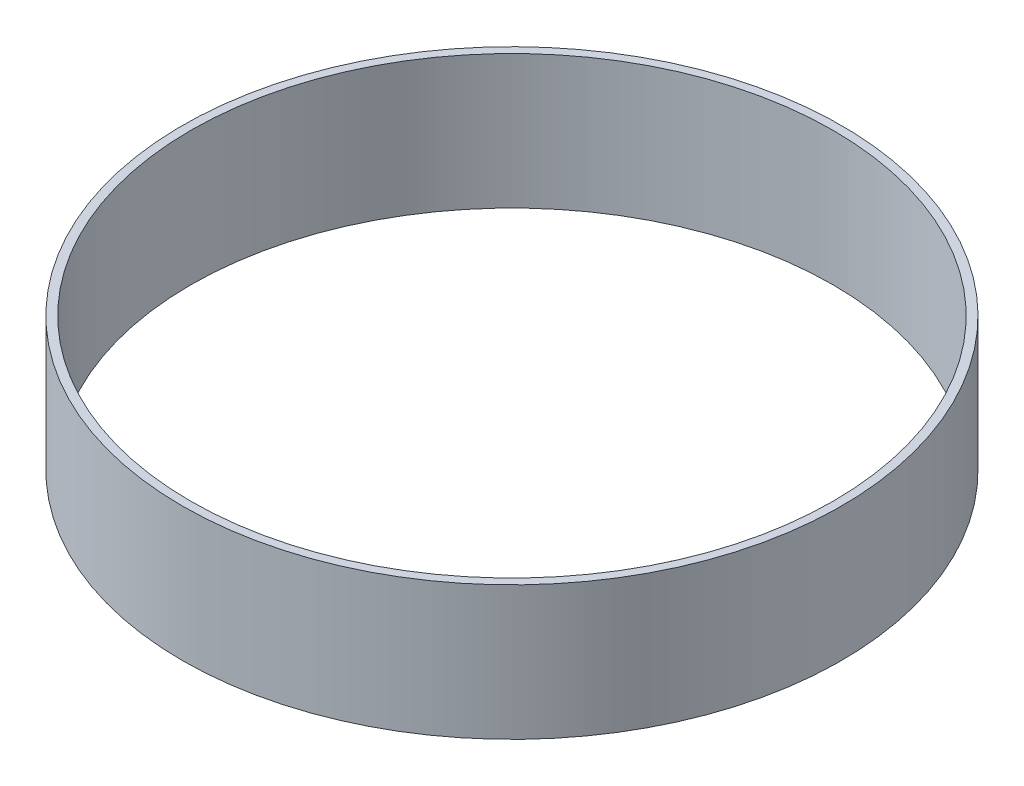
ISO-10303-21;
HEADER;
FILE_DESCRIPTION(('STEP AP214'),'2;1');
FILE_NAME('part.step','',(''),(''),'','','');
FILE_SCHEMA(('AUTOMOTIVE_DESIGN { 1 0 10303 214 1 1 1 1 }'));
ENDSEC;
DATA;
#1=APPLICATION_CONTEXT('core data for automotive mechanical design processes');
#2=APPLICATION_PROTOCOL_DEFINITION('international standard','automotive_design',2000,#1);
#3=PRODUCT_CONTEXT('',#1,'mechanical');
#4=PRODUCT('Part','Part','',(#3));
#5=PRODUCT_RELATED_PRODUCT_CATEGORY('part','',(#4));
#6=PRODUCT_DEFINITION_FORMATION('','',#4);
#7=PRODUCT_DEFINITION_CONTEXT('part definition',#1,'design');
#8=PRODUCT_DEFINITION('design','',#6,#7);
#9=PRODUCT_DEFINITION_SHAPE('','',#8);
#10=(LENGTH_UNIT() NAMED_UNIT(*) SI_UNIT(.MILLI.,.METRE.));
#11=(NAMED_UNIT(*) PLANE_ANGLE_UNIT() SI_UNIT($,.RADIAN.));
#12=(NAMED_UNIT(*) SI_UNIT($,.STERADIAN.) SOLID_ANGLE_UNIT());
#13=UNCERTAINTY_MEASURE_WITH_UNIT(LENGTH_MEASURE(1.E-05),#10,'distance_accuracy_value','');
#14=(GEOMETRIC_REPRESENTATION_CONTEXT(3) GLOBAL_UNCERTAINTY_ASSIGNED_CONTEXT((#13)) GLOBAL_UNIT_ASSIGNED_CONTEXT((#10,
#11,#12)) REPRESENTATION_CONTEXT('',''));
#15=CARTESIAN_POINT('',(0.,0.,0.));
#16=DIRECTION('',(0.,0.,1.));
#17=DIRECTION('',(1.,0.,0.));
#18=AXIS2_PLACEMENT_3D('',#15,#16,#17);
#19=CARTESIAN_POINT('',(0.,40.,0.));
#20=DIRECTION('',(0.,1.,0.));
#21=DIRECTION('',(0.,0.,1.));
#22=AXIS2_PLACEMENT_3D('',#19,#20,#21);
#23=PLANE('',#22);
#24=CARTESIAN_POINT('',(0.,40.,0.));
#25=DIRECTION('',(0.,1.,0.));
#26=DIRECTION('',(0.,0.,1.));
#27=AXIS2_PLACEMENT_3D('',#24,#25,#26);
#28=CIRCLE('',#27,98.5);
#29=CARTESIAN_POINT('',(0.,40.,98.5));
#30=VERTEX_POINT('',#29);
#31=EDGE_CURVE('E10',#30,#30,#28,.T.);
#32=ORIENTED_EDGE('',*,*,#31,.T.);
#33=EDGE_LOOP('',(#32));
#34=FACE_BOUND('',#33,.T.);
#35=CARTESIAN_POINT('',(0.,40.,0.));
#36=DIRECTION('',(0.,1.,0.));
#37=DIRECTION('',(0.,0.,1.));
#38=AXIS2_PLACEMENT_3D('',#35,#36,#37);
#39=CIRCLE('',#38,96.);
#40=CARTESIAN_POINT('',(0.,40.,96.));
#41=VERTEX_POINT('',#40);
#42=EDGE_CURVE('E42',#41,#41,#39,.T.);
#43=ORIENTED_EDGE('',*,*,#42,.F.);
#44=EDGE_LOOP('',(#43));
#45=FACE_BOUND('',#44,.T.);
#46=ADVANCED_FACE('F31',(#34,#45),#23,.T.);
#47=CARTESIAN_POINT('',(0.,0.,0.));
#48=DIRECTION('',(0.,1.,0.));
#49=DIRECTION('',(0.,0.,1.));
#50=AXIS2_PLACEMENT_3D('',#47,#48,#49);
#51=PLANE('',#50);
#52=CARTESIAN_POINT('',(0.,0.,0.));
#53=DIRECTION('',(0.,1.,0.));
#54=DIRECTION('',(0.,0.,1.));
#55=AXIS2_PLACEMENT_3D('',#52,#53,#54);
#56=CIRCLE('',#55,98.5);
#57=CARTESIAN_POINT('',(0.,0.,98.5));
#58=VERTEX_POINT('',#57);
#59=EDGE_CURVE('E35',#58,#58,#56,.T.);
#60=ORIENTED_EDGE('',*,*,#59,.F.);
#61=EDGE_LOOP('',(#60));
#62=FACE_BOUND('',#61,.T.);
#63=CARTESIAN_POINT('',(0.,0.,0.));
#64=DIRECTION('',(0.,1.,0.));
#65=DIRECTION('',(0.,0.,1.));
#66=AXIS2_PLACEMENT_3D('',#63,#64,#65);
#67=CIRCLE('',#66,96.);
#68=CARTESIAN_POINT('',(0.,0.,96.));
#69=VERTEX_POINT('',#68);
#70=EDGE_CURVE('E44',#69,#69,#67,.T.);
#71=ORIENTED_EDGE('',*,*,#70,.T.);
#72=EDGE_LOOP('',(#71));
#73=FACE_BOUND('',#72,.T.);
#74=ADVANCED_FACE('F54',(#62,#73),#51,.F.);
#75=CARTESIAN_POINT('',(0.,40.,0.));
#76=DIRECTION('',(0.,-1.,0.));
#77=DIRECTION('',(0.,0.,-1.));
#78=AXIS2_PLACEMENT_3D('',#75,#76,#77);
#79=CYLINDRICAL_SURFACE('',#78,98.5);
#80=ORIENTED_EDGE('',*,*,#31,.F.);
#81=EDGE_LOOP('',(#80));
#82=FACE_BOUND('',#81,.T.);
#83=ORIENTED_EDGE('',*,*,#59,.T.);
#84=EDGE_LOOP('',(#83));
#85=FACE_BOUND('',#84,.T.);
#86=ADVANCED_FACE('F33',(#82,#85),#79,.T.);
#87=CARTESIAN_POINT('',(0.,40.,0.));
#88=DIRECTION('',(0.,-1.,0.));
#89=DIRECTION('',(0.,0.,-1.));
#90=AXIS2_PLACEMENT_3D('',#87,#88,#89);
#91=CYLINDRICAL_SURFACE('',#90,96.);
#92=ORIENTED_EDGE('',*,*,#42,.T.);
#93=EDGE_LOOP('',(#92));
#94=FACE_BOUND('',#93,.T.);
#95=ORIENTED_EDGE('',*,*,#70,.F.);
#96=EDGE_LOOP('',(#95));
#97=FACE_BOUND('',#96,.T.);
#98=ADVANCED_FACE('F50',(#94,#97),#91,.F.);
#99=CLOSED_SHELL('',(#46,#74,#86,#98));
#100=MANIFOLD_SOLID_BREP('B2',#99);
#101=ADVANCED_BREP_SHAPE_REPRESENTATION('',(#18,#100),#14);
#102=SHAPE_DEFINITION_REPRESENTATION(#9,#101);
ENDSEC;
END-ISO-10303-21;
